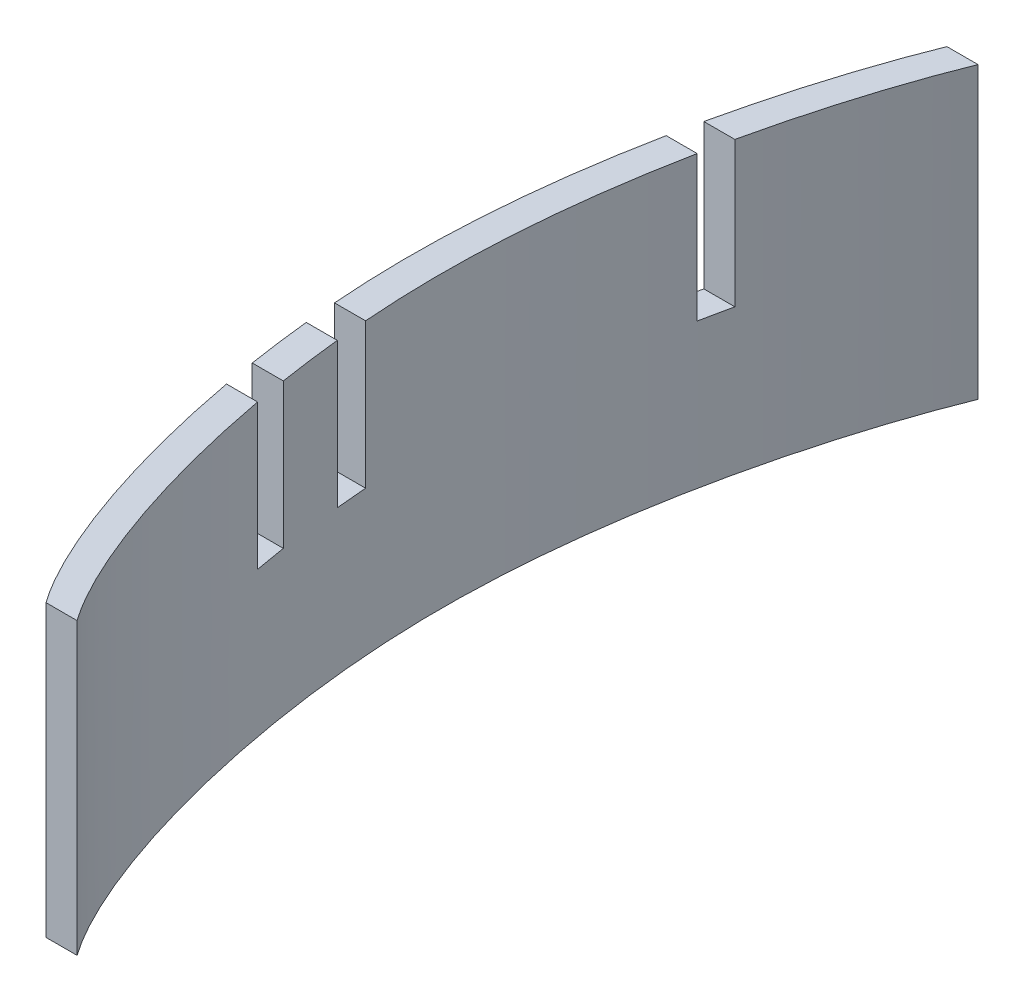
ISO-10303-21;
HEADER;
FILE_DESCRIPTION(('STEP AP214'),'2;1');
FILE_NAME('part.step','',(''),(''),'','','');
FILE_SCHEMA(('AUTOMOTIVE_DESIGN { 1 0 10303 214 1 1 1 1 }'));
ENDSEC;
DATA;
#1=APPLICATION_CONTEXT('core data for automotive mechanical design processes');
#2=APPLICATION_PROTOCOL_DEFINITION('international standard','automotive_design',2000,#1);
#3=PRODUCT_CONTEXT('',#1,'mechanical');
#4=PRODUCT('Part','Part','',(#3));
#5=PRODUCT_RELATED_PRODUCT_CATEGORY('part','',(#4));
#6=PRODUCT_DEFINITION_FORMATION('','',#4);
#7=PRODUCT_DEFINITION_CONTEXT('part definition',#1,'design');
#8=PRODUCT_DEFINITION('design','',#6,#7);
#9=PRODUCT_DEFINITION_SHAPE('','',#8);
#10=(LENGTH_UNIT() NAMED_UNIT(*) SI_UNIT(.MILLI.,.METRE.));
#11=(NAMED_UNIT(*) PLANE_ANGLE_UNIT() SI_UNIT($,.RADIAN.));
#12=(NAMED_UNIT(*) SI_UNIT($,.STERADIAN.) SOLID_ANGLE_UNIT());
#13=UNCERTAINTY_MEASURE_WITH_UNIT(LENGTH_MEASURE(1.E-05),#10,'distance_accuracy_value','');
#14=(GEOMETRIC_REPRESENTATION_CONTEXT(3) GLOBAL_UNCERTAINTY_ASSIGNED_CONTEXT((#13)) GLOBAL_UNIT_ASSIGNED_CONTEXT((#10,
#11,#12)) REPRESENTATION_CONTEXT('',''));
#15=CARTESIAN_POINT('',(0.,0.,0.));
#16=DIRECTION('',(0.,0.,1.));
#17=DIRECTION('',(1.,0.,0.));
#18=AXIS2_PLACEMENT_3D('',#15,#16,#17);
#19=CARTESIAN_POINT('',(-48.7290664504318,0.,571.5));
#20=DIRECTION('',(0.,-1.,0.));
#21=DIRECTION('',(1.,0.,0.));
#22=AXIS2_PLACEMENT_3D('',#19,#20,#21);
#23=PLANE('',#22);
#24=DIRECTION('',(-1.,0.,0.));
#25=VECTOR('',#24,1.);
#26=CARTESIAN_POINT('',(-71.1598715205342,0.,228.6));
#27=LINE('',#26,#25);
#28=CARTESIAN_POINT('',(-31.4992675978472,0.,228.6));
#29=VERTEX_POINT('',#28);
#30=CARTESIAN_POINT('',(-69.5774364766293,0.,228.6));
#31=VERTEX_POINT('',#30);
#32=EDGE_CURVE('E244',#29,#31,#27,.T.);
#33=ORIENTED_EDGE('',*,*,#32,.F.);
#34=CARTESIAN_POINT('',(38.1,0.,0.));
#35=CARTESIAN_POINT('',(-10.0467858208071,0.,118.711942806905));
#36=CARTESIAN_POINT('',(-135.555393431846,0.,564.904353861576));
#37=CARTESIAN_POINT('',(5.93276871520132,0.,1043.95619947961));
#38=CARTESIAN_POINT('',(76.2,0.,1143.));
#39=B_SPLINE_CURVE_WITH_KNOTS('',3,(#34,#35,#36,#37,#38),.UNSPECIFIED.,.F.,.F.,(4,1,4),(0.,
0.498249853333726,1.),.UNSPECIFIED.);
#40=CARTESIAN_POINT('',(38.1,0.,0.));
#41=VERTEX_POINT('',#40);
#42=EDGE_CURVE('E381',#41,#29,#39,.T.);
#43=ORIENTED_EDGE('',*,*,#42,.F.);
#44=DIRECTION('',(1.,0.,0.));
#45=VECTOR('',#44,1.);
#46=CARTESIAN_POINT('',(44.7485655108204,0.,0.));
#47=LINE('',#46,#45);
#48=CARTESIAN_POINT('',(0.,0.,0.));
#49=VERTEX_POINT('',#48);
#50=EDGE_CURVE('E373',#49,#41,#47,.T.);
#51=ORIENTED_EDGE('',*,*,#50,.F.);
#52=CARTESIAN_POINT('',(0.,0.,0.));
#53=CARTESIAN_POINT('',(-48.1467858208071,0.,119.037022806313));
#54=CARTESIAN_POINT('',(-173.658132900864,0.,564.418743215032));
#55=CARTESIAN_POINT('',(-32.1617138562553,0.,1044.60458024195));
#56=CARTESIAN_POINT('',(38.1,0.,1143.));
#57=B_SPLINE_CURVE_WITH_KNOTS('',3,(#52,#53,#54,#55,#56),.UNSPECIFIED.,.F.,.F.,(4,1,4),(0.,
0.498249853333726,1.),.UNSPECIFIED.);
#58=EDGE_CURVE('E383',#49,#31,#57,.T.);
#59=ORIENTED_EDGE('',*,*,#58,.T.);
#60=EDGE_LOOP('',(#33,#43,#51,#59));
#61=FACE_BOUND('',#60,.T.);
#62=ADVANCED_FACE('F26',(#61),#23,.F.);
#63=DIRECTION('',(-1.,0.,0.));
#64=VECTOR('',#63,1.);
#65=CARTESIAN_POINT('',(0.578483325075707,0.,762.));
#66=LINE('',#65,#64);
#67=CARTESIAN_POINT('',(-51.8416475571497,0.,761.999999990289));
#68=VERTEX_POINT('',#67);
#69=CARTESIAN_POINT('',(-89.9624727592618,0.,761.999999990288));
#70=VERTEX_POINT('',#69);
#71=EDGE_CURVE('E231',#68,#70,#66,.T.);
#72=ORIENTED_EDGE('',*,*,#71,.F.);
#73=CARTESIAN_POINT('',(-61.8416678867795,0.,685.8));
#74=VERTEX_POINT('',#73);
#75=EDGE_CURVE('E372',#74,#68,#39,.T.);
#76=ORIENTED_EDGE('',*,*,#75,.F.);
#77=DIRECTION('',(-1.,0.,0.));
#78=VECTOR('',#77,1.);
#79=CARTESIAN_POINT('',(-78.7390953842666,0.,685.8));
#80=LINE('',#79,#78);
#81=CARTESIAN_POINT('',(-99.9482149838871,0.,685.8));
#82=VERTEX_POINT('',#81);
#83=EDGE_CURVE('E281',#74,#82,#80,.T.);
#84=ORIENTED_EDGE('',*,*,#83,.T.);
#85=EDGE_CURVE('E532',#82,#70,#57,.T.);
#86=ORIENTED_EDGE('',*,*,#85,.T.);
#87=EDGE_LOOP('',(#72,#76,#84,#86));
#88=FACE_BOUND('',#87,.T.);
#89=ADVANCED_FACE('F343',(#88),#23,.F.);
#90=CARTESIAN_POINT('',(0.,-355.6,0.));
#91=CARTESIAN_POINT('',(-48.1467858208071,-355.6,119.037022806313));
#92=CARTESIAN_POINT('',(-173.658132900864,-355.6,564.418743215032));
#93=CARTESIAN_POINT('',(-32.1617138562553,-355.6,1044.60458024195));
#94=CARTESIAN_POINT('',(38.1,-355.6,1143.));
#95=B_SPLINE_CURVE_WITH_KNOTS('',3,(#90,#91,#92,#93,#94),.UNSPECIFIED.,.F.,.F.,(4,1,4),(0.,
0.498249853333726,1.),.UNSPECIFIED.);
#96=DIRECTION('',(0.,1.,0.));
#97=VECTOR('',#96,1.);
#98=SURFACE_OF_LINEAR_EXTRUSION('',#95,#97);
#99=CARTESIAN_POINT('',(0.,-177.8,0.));
#100=CARTESIAN_POINT('',(-48.1467858208071,-177.8,119.037022806313));
#101=CARTESIAN_POINT('',(-173.658132900864,-177.8,564.418743215032));
#102=CARTESIAN_POINT('',(-32.1617138562553,-177.8,1044.60458024195));
#103=CARTESIAN_POINT('',(38.1,-177.8,1143.));
#104=B_SPLINE_CURVE_WITH_KNOTS('',3,(#99,#100,#101,#102,#103),.UNSPECIFIED.,.F.,.F.,(4,1,4),(0.,
0.498249853333726,1.),.UNSPECIFIED.);
#105=CARTESIAN_POINT('',(-69.5774364766293,-177.8,228.6));
#106=VERTEX_POINT('',#105);
#107=CARTESIAN_POINT('',(-77.6247615668051,-177.8,266.699999999937));
#108=VERTEX_POINT('',#107);
#109=EDGE_CURVE('E175',#106,#108,#104,.T.);
#110=ORIENTED_EDGE('',*,*,#109,.F.);
#111=DIRECTION('',(0.,1.,0.));
#112=VECTOR('',#111,1.);
#113=CARTESIAN_POINT('',(-69.5774364766293,-177.8,228.6));
#114=LINE('',#113,#112);
#115=EDGE_CURVE('E199',#106,#31,#114,.T.);
#116=ORIENTED_EDGE('',*,*,#115,.T.);
#117=ORIENTED_EDGE('',*,*,#58,.F.);
#118=DIRECTION('',(0.,1.,0.));
#119=VECTOR('',#118,1.);
#120=CARTESIAN_POINT('',(0.,-355.6,0.));
#121=LINE('',#120,#119);
#122=CARTESIAN_POINT('',(0.,-355.6,0.));
#123=VERTEX_POINT('',#122);
#124=EDGE_CURVE('E13',#123,#49,#121,.T.);
#125=ORIENTED_EDGE('',*,*,#124,.F.);
#126=CARTESIAN_POINT('',(38.1,-355.6,1143.));
#127=VERTEX_POINT('',#126);
#128=EDGE_CURVE('E301',#123,#127,#95,.T.);
#129=ORIENTED_EDGE('',*,*,#128,.T.);
#130=DIRECTION('',(0.,1.,0.));
#131=VECTOR('',#130,1.);
#132=CARTESIAN_POINT('',(38.1,-355.6,1143.));
#133=LINE('',#132,#131);
#134=CARTESIAN_POINT('',(38.1,0.,1143.));
#135=VERTEX_POINT('',#134);
#136=EDGE_CURVE('E402',#127,#135,#133,.T.);
#137=ORIENTED_EDGE('',*,*,#136,.T.);
#138=CARTESIAN_POINT('',(-83.432209743934,0.,800.1));
#139=VERTEX_POINT('',#138);
#140=EDGE_CURVE('E300',#139,#135,#57,.T.);
#141=ORIENTED_EDGE('',*,*,#140,.F.);
#142=DIRECTION('',(0.,1.,0.));
#143=VECTOR('',#142,1.);
#144=CARTESIAN_POINT('',(-83.432209743934,-177.8,800.1));
#145=LINE('',#144,#143);
#146=CARTESIAN_POINT('',(-83.432209743934,-177.8,800.1));
#147=VERTEX_POINT('',#146);
#148=EDGE_CURVE('E217',#147,#139,#145,.T.);
#149=ORIENTED_EDGE('',*,*,#148,.F.);
#150=CARTESIAN_POINT('',(0.,-177.8,0.));
#151=CARTESIAN_POINT('',(-48.1467858208071,-177.8,119.037022806313));
#152=CARTESIAN_POINT('',(-173.658132900864,-177.8,564.418743215032));
#153=CARTESIAN_POINT('',(-32.1617138562553,-177.8,1044.60458024195));
#154=CARTESIAN_POINT('',(38.1,-177.8,1143.));
#155=B_SPLINE_CURVE_WITH_KNOTS('',3,(#150,#151,#152,#153,#154),.UNSPECIFIED.,.F.,.F.,(4,1,4),
(0.,0.498249853333726,1.),.UNSPECIFIED.);
#156=CARTESIAN_POINT('',(-89.9624727592618,-177.8,761.999999990288));
#157=VERTEX_POINT('',#156);
#158=EDGE_CURVE('E214',#157,#147,#155,.T.);
#159=ORIENTED_EDGE('',*,*,#158,.F.);
#160=DIRECTION('',(0.,1.,0.));
#161=VECTOR('',#160,1.);
#162=CARTESIAN_POINT('',(-89.9624727592618,-177.8,761.999999990288));
#163=LINE('',#162,#161);
#164=EDGE_CURVE('E248',#157,#70,#163,.T.);
#165=ORIENTED_EDGE('',*,*,#164,.T.);
#166=ORIENTED_EDGE('',*,*,#85,.F.);
#167=DIRECTION('',(0.,1.,0.));
#168=VECTOR('',#167,1.);
#169=CARTESIAN_POINT('',(-99.9482149838871,-177.8,685.8));
#170=LINE('',#169,#168);
#171=CARTESIAN_POINT('',(-99.9482149838871,-177.8,685.8));
#172=VERTEX_POINT('',#171);
#173=EDGE_CURVE('E270',#172,#82,#170,.T.);
#174=ORIENTED_EDGE('',*,*,#173,.F.);
#175=CARTESIAN_POINT('',(0.,-177.8,0.));
#176=CARTESIAN_POINT('',(-48.1467858208071,-177.8,119.037022806313));
#177=CARTESIAN_POINT('',(-173.658132900864,-177.8,564.418743215032));
#178=CARTESIAN_POINT('',(-32.1617138562553,-177.8,1044.60458024195));
#179=CARTESIAN_POINT('',(38.1,-177.8,1143.));
#180=B_SPLINE_CURVE_WITH_KNOTS('',3,(#175,#176,#177,#178,#179),.UNSPECIFIED.,.F.,.F.,(4,1,4),
(0.,0.498249853333726,1.),.UNSPECIFIED.);
#181=CARTESIAN_POINT('',(-103.378321645484,-177.8,647.700000003491));
#182=VERTEX_POINT('',#181);
#183=EDGE_CURVE('E262',#182,#172,#180,.T.);
#184=ORIENTED_EDGE('',*,*,#183,.F.);
#185=DIRECTION('',(0.,1.,0.));
#186=VECTOR('',#185,1.);
#187=CARTESIAN_POINT('',(-103.378321645484,-177.8,647.700000003491));
#188=LINE('',#187,#186);
#189=CARTESIAN_POINT('',(-103.378321645484,0.,647.700000003491));
#190=VERTEX_POINT('',#189);
#191=EDGE_CURVE('E290',#182,#190,#188,.T.);
#192=ORIENTED_EDGE('',*,*,#191,.T.);
#193=CARTESIAN_POINT('',(-77.6247615668051,0.,266.699999999937));
#194=VERTEX_POINT('',#193);
#195=EDGE_CURVE('E197',#194,#190,#57,.T.);
#196=ORIENTED_EDGE('',*,*,#195,.F.);
#197=DIRECTION('',(0.,1.,0.));
#198=VECTOR('',#197,1.);
#199=CARTESIAN_POINT('',(-77.6247615668051,-177.8,266.699999999937));
#200=LINE('',#199,#198);
#201=EDGE_CURVE('E187',#108,#194,#200,.T.);
#202=ORIENTED_EDGE('',*,*,#201,.F.);
#203=EDGE_LOOP('',(#110,#116,#117,#125,#129,#137,#141,#149,#159,#165,#166,#174,#184,#192,#196,#202));
#204=FACE_BOUND('',#203,.T.);
#205=ADVANCED_FACE('F28',(#204),#98,.T.);
#206=CARTESIAN_POINT('',(-39.5402036904433,0.,266.699999999938));
#207=VERTEX_POINT('',#206);
#208=CARTESIAN_POINT('',(-65.2757125774557,0.,647.700000003653));
#209=VERTEX_POINT('',#208);
#210=EDGE_CURVE('E375',#207,#209,#39,.T.);
#211=ORIENTED_EDGE('',*,*,#210,.F.);
#212=DIRECTION('',(-1.,0.,0.));
#213=VECTOR('',#212,1.);
#214=CARTESIAN_POINT('',(-77.1633275361347,0.,266.7));
#215=LINE('',#214,#213);
#216=EDGE_CURVE('E183',#207,#194,#215,.T.);
#217=ORIENTED_EDGE('',*,*,#216,.T.);
#218=ORIENTED_EDGE('',*,*,#195,.T.);
#219=DIRECTION('',(-1.,0.,0.));
#220=VECTOR('',#219,1.);
#221=CARTESIAN_POINT('',(-81.5796891418827,0.,647.7));
#222=LINE('',#221,#220);
#223=EDGE_CURVE('E277',#209,#190,#222,.T.);
#224=ORIENTED_EDGE('',*,*,#223,.F.);
#225=EDGE_LOOP('',(#211,#217,#218,#224));
#226=FACE_BOUND('',#225,.T.);
#227=ADVANCED_FACE('F335',(#226),#23,.F.);
#228=CARTESIAN_POINT('',(44.7485655108204,-355.6,0.));
#229=DIRECTION('',(0.,0.,1.));
#230=DIRECTION('',(1.,0.,0.));
#231=AXIS2_PLACEMENT_3D('',#228,#229,#230);
#232=PLANE('',#231);
#233=ORIENTED_EDGE('',*,*,#50,.T.);
#234=DIRECTION('',(0.,1.,0.));
#235=VECTOR('',#234,1.);
#236=CARTESIAN_POINT('',(38.1,-355.6,0.));
#237=LINE('',#236,#235);
#238=CARTESIAN_POINT('',(38.1,-355.6,0.));
#239=VERTEX_POINT('',#238);
#240=EDGE_CURVE('E36',#239,#41,#237,.T.);
#241=ORIENTED_EDGE('',*,*,#240,.F.);
#242=DIRECTION('',(1.,0.,0.));
#243=VECTOR('',#242,1.);
#244=CARTESIAN_POINT('',(44.7485655108204,-355.6,0.));
#245=LINE('',#244,#243);
#246=EDGE_CURVE('E308',#123,#239,#245,.T.);
#247=ORIENTED_EDGE('',*,*,#246,.F.);
#248=ORIENTED_EDGE('',*,*,#124,.T.);
#249=EDGE_LOOP('',(#233,#241,#247,#248));
#250=FACE_BOUND('',#249,.T.);
#251=ADVANCED_FACE('F331',(#250),#232,.F.);
#252=CARTESIAN_POINT('',(38.1,-355.6,0.));
#253=CARTESIAN_POINT('',(-10.0467858208071,-355.6,118.711942806905));
#254=CARTESIAN_POINT('',(-135.555393431846,-355.6,564.904353861576));
#255=CARTESIAN_POINT('',(5.93276871520132,-355.6,1043.95619947961));
#256=CARTESIAN_POINT('',(76.2,-355.6,1143.));
#257=B_SPLINE_CURVE_WITH_KNOTS('',3,(#252,#253,#254,#255,#256),.UNSPECIFIED.,.F.,.F.,(4,1,4),
(0.,0.498249853333726,1.),.UNSPECIFIED.);
#258=DIRECTION('',(0.,1.,0.));
#259=VECTOR('',#258,1.);
#260=SURFACE_OF_LINEAR_EXTRUSION('',#257,#259);
#261=CARTESIAN_POINT('',(38.1,-177.8,0.));
#262=CARTESIAN_POINT('',(-10.0467858208071,-177.8,118.711942806905));
#263=CARTESIAN_POINT('',(-135.555393431846,-177.8,564.904353861576));
#264=CARTESIAN_POINT('',(5.93276871520132,-177.8,1043.95619947961));
#265=CARTESIAN_POINT('',(76.2,-177.8,1143.));
#266=B_SPLINE_CURVE_WITH_KNOTS('',3,(#261,#262,#263,#264,#265),.UNSPECIFIED.,.F.,.F.,(4,1,4),
(0.,0.498249853333726,1.),.UNSPECIFIED.);
#267=CARTESIAN_POINT('',(-31.4992675978472,-177.8,228.6));
#268=VERTEX_POINT('',#267);
#269=CARTESIAN_POINT('',(-39.5402036904557,-177.8,266.7));
#270=VERTEX_POINT('',#269);
#271=EDGE_CURVE('E193',#268,#270,#266,.T.);
#272=ORIENTED_EDGE('',*,*,#271,.T.);
#273=DIRECTION('',(0.,1.,0.));
#274=VECTOR('',#273,1.);
#275=CARTESIAN_POINT('',(-39.5402036904433,-177.8,266.699999999938));
#276=LINE('',#275,#274);
#277=EDGE_CURVE('E190',#270,#207,#276,.T.);
#278=ORIENTED_EDGE('',*,*,#277,.T.);
#279=ORIENTED_EDGE('',*,*,#210,.T.);
#280=DIRECTION('',(0.,1.,0.));
#281=VECTOR('',#280,1.);
#282=CARTESIAN_POINT('',(-65.2757125774557,-177.8,647.700000003653));
#283=LINE('',#282,#281);
#284=CARTESIAN_POINT('',(-65.2757125774557,-177.8,647.700000003653));
#285=VERTEX_POINT('',#284);
#286=EDGE_CURVE('E293',#285,#209,#283,.T.);
#287=ORIENTED_EDGE('',*,*,#286,.F.);
#288=CARTESIAN_POINT('',(38.1,-177.8,0.));
#289=CARTESIAN_POINT('',(-10.0467858208071,-177.8,118.711942806905));
#290=CARTESIAN_POINT('',(-135.555393431846,-177.8,564.904353861576));
#291=CARTESIAN_POINT('',(5.93276871520132,-177.8,1043.95619947961));
#292=CARTESIAN_POINT('',(76.2,-177.8,1143.));
#293=B_SPLINE_CURVE_WITH_KNOTS('',3,(#288,#289,#290,#291,#292),.UNSPECIFIED.,.F.,.F.,(4,1,4),
(0.,0.498249853333726,1.),.UNSPECIFIED.);
#294=CARTESIAN_POINT('',(-61.8416678867795,-177.8,685.8));
#295=VERTEX_POINT('',#294);
#296=EDGE_CURVE('E254',#285,#295,#293,.T.);
#297=ORIENTED_EDGE('',*,*,#296,.T.);
#298=DIRECTION('',(0.,1.,0.));
#299=VECTOR('',#298,1.);
#300=CARTESIAN_POINT('',(-61.8416678867795,-177.8,685.8));
#301=LINE('',#300,#299);
#302=EDGE_CURVE('E297',#295,#74,#301,.T.);
#303=ORIENTED_EDGE('',*,*,#302,.T.);
#304=ORIENTED_EDGE('',*,*,#75,.T.);
#305=DIRECTION('',(0.,1.,0.));
#306=VECTOR('',#305,1.);
#307=CARTESIAN_POINT('',(-51.8416475571497,-177.8,761.999999990289));
#308=LINE('',#307,#306);
#309=CARTESIAN_POINT('',(-51.8416475571497,-177.8,761.999999990289));
#310=VERTEX_POINT('',#309);
#311=EDGE_CURVE('E245',#310,#68,#308,.T.);
#312=ORIENTED_EDGE('',*,*,#311,.F.);
#313=CARTESIAN_POINT('',(38.1,-177.8,0.));
#314=CARTESIAN_POINT('',(-10.0467858208071,-177.8,118.711942806905));
#315=CARTESIAN_POINT('',(-135.555393431846,-177.8,564.904353861576));
#316=CARTESIAN_POINT('',(5.93276871520132,-177.8,1043.95619947961));
#317=CARTESIAN_POINT('',(76.2,-177.8,1143.));
#318=B_SPLINE_CURVE_WITH_KNOTS('',3,(#313,#314,#315,#316,#317),.UNSPECIFIED.,.F.,.F.,(4,1,4),
(0.,0.498249853333726,1.),.UNSPECIFIED.);
#319=CARTESIAN_POINT('',(-45.3009926513268,-177.8,800.1));
#320=VERTEX_POINT('',#319);
#321=EDGE_CURVE('E213',#310,#320,#318,.T.);
#322=ORIENTED_EDGE('',*,*,#321,.T.);
#323=DIRECTION('',(0.,1.,0.));
#324=VECTOR('',#323,1.);
#325=CARTESIAN_POINT('',(-45.3009926513255,-177.8,800.1));
#326=LINE('',#325,#324);
#327=CARTESIAN_POINT('',(-45.3009926513255,0.,800.1));
#328=VERTEX_POINT('',#327);
#329=EDGE_CURVE('E240',#320,#328,#326,.T.);
#330=ORIENTED_EDGE('',*,*,#329,.T.);
#331=CARTESIAN_POINT('',(76.2,0.,1143.));
#332=VERTEX_POINT('',#331);
#333=EDGE_CURVE('E366',#328,#332,#39,.T.);
#334=ORIENTED_EDGE('',*,*,#333,.T.);
#335=DIRECTION('',(0.,1.,0.));
#336=VECTOR('',#335,1.);
#337=CARTESIAN_POINT('',(76.2,-355.6,1143.));
#338=LINE('',#337,#336);
#339=CARTESIAN_POINT('',(76.2,-355.6,1143.));
#340=VERTEX_POINT('',#339);
#341=EDGE_CURVE('E406',#340,#332,#338,.T.);
#342=ORIENTED_EDGE('',*,*,#341,.F.);
#343=EDGE_CURVE('E315',#239,#340,#257,.T.);
#344=ORIENTED_EDGE('',*,*,#343,.F.);
#345=ORIENTED_EDGE('',*,*,#240,.T.);
#346=ORIENTED_EDGE('',*,*,#42,.T.);
#347=DIRECTION('',(0.,1.,0.));
#348=VECTOR('',#347,1.);
#349=CARTESIAN_POINT('',(-31.4992675978472,-177.8,228.6));
#350=LINE('',#349,#348);
#351=EDGE_CURVE('E205',#268,#29,#350,.T.);
#352=ORIENTED_EDGE('',*,*,#351,.F.);
#353=EDGE_LOOP('',(#272,#278,#279,#287,#297,#303,#304,#312,#322,#330,#334,#342,#344,#345,#346,#352));
#354=FACE_BOUND('',#353,.T.);
#355=ADVANCED_FACE('F327',(#354),#260,.F.);
#356=CARTESIAN_POINT('',(48.1458373560539,-355.6,1143.));
#357=DIRECTION('',(0.,0.,1.));
#358=DIRECTION('',(1.,0.,0.));
#359=AXIS2_PLACEMENT_3D('',#356,#357,#358);
#360=PLANE('',#359);
#361=DIRECTION('',(1.,0.,0.));
#362=VECTOR('',#361,1.);
#363=CARTESIAN_POINT('',(48.1458373560539,0.,1143.));
#364=LINE('',#363,#362);
#365=EDGE_CURVE('E309',#135,#332,#364,.T.);
#366=ORIENTED_EDGE('',*,*,#365,.F.);
#367=ORIENTED_EDGE('',*,*,#136,.F.);
#368=DIRECTION('',(1.,0.,0.));
#369=VECTOR('',#368,1.);
#370=CARTESIAN_POINT('',(48.1458373560539,-355.6,1143.));
#371=LINE('',#370,#369);
#372=EDGE_CURVE('E321',#127,#340,#371,.T.);
#373=ORIENTED_EDGE('',*,*,#372,.T.);
#374=ORIENTED_EDGE('',*,*,#341,.T.);
#375=EDGE_LOOP('',(#366,#367,#373,#374));
#376=FACE_BOUND('',#375,.T.);
#377=ADVANCED_FACE('F330',(#376),#360,.T.);
#378=CARTESIAN_POINT('',(-48.7290664504318,-355.6,571.5));
#379=DIRECTION('',(0.,-1.,0.));
#380=DIRECTION('',(1.,0.,0.));
#381=AXIS2_PLACEMENT_3D('',#378,#379,#380);
#382=PLANE('',#381);
#383=ORIENTED_EDGE('',*,*,#128,.F.);
#384=ORIENTED_EDGE('',*,*,#246,.T.);
#385=ORIENTED_EDGE('',*,*,#343,.T.);
#386=ORIENTED_EDGE('',*,*,#372,.F.);
#387=EDGE_LOOP('',(#383,#384,#385,#386));
#388=FACE_BOUND('',#387,.T.);
#389=ADVANCED_FACE('F354',(#388),#382,.T.);
#390=ORIENTED_EDGE('',*,*,#333,.F.);
#391=DIRECTION('',(-1.,0.,0.));
#392=VECTOR('',#391,1.);
#393=CARTESIAN_POINT('',(9.22358363799858,0.,800.1));
#394=LINE('',#393,#392);
#395=EDGE_CURVE('E230',#328,#139,#394,.T.);
#396=ORIENTED_EDGE('',*,*,#395,.T.);
#397=ORIENTED_EDGE('',*,*,#140,.T.);
#398=ORIENTED_EDGE('',*,*,#365,.T.);
#399=EDGE_LOOP('',(#390,#396,#397,#398));
#400=FACE_BOUND('',#399,.T.);
#401=ADVANCED_FACE('F342',(#400),#23,.F.);
#402=CARTESIAN_POINT('',(-78.7390953842666,-177.8,685.8));
#403=DIRECTION('',(0.,0.,-1.));
#404=DIRECTION('',(-1.,0.,0.));
#405=AXIS2_PLACEMENT_3D('',#402,#403,#404);
#406=PLANE('',#405);
#407=ORIENTED_EDGE('',*,*,#83,.F.);
#408=ORIENTED_EDGE('',*,*,#302,.F.);
#409=DIRECTION('',(-1.,0.,0.));
#410=VECTOR('',#409,1.);
#411=CARTESIAN_POINT('',(-78.7390953842666,-177.8,685.8));
#412=LINE('',#411,#410);
#413=EDGE_CURVE('E261',#295,#172,#412,.T.);
#414=ORIENTED_EDGE('',*,*,#413,.T.);
#415=ORIENTED_EDGE('',*,*,#173,.T.);
#416=EDGE_LOOP('',(#407,#408,#414,#415));
#417=FACE_BOUND('',#416,.T.);
#418=ADVANCED_FACE('F353',(#417),#406,.T.);
#419=CARTESIAN_POINT('',(-81.5796891418827,-177.8,647.7));
#420=DIRECTION('',(0.,0.,-1.));
#421=DIRECTION('',(-1.,0.,0.));
#422=AXIS2_PLACEMENT_3D('',#419,#420,#421);
#423=PLANE('',#422);
#424=ORIENTED_EDGE('',*,*,#223,.T.);
#425=ORIENTED_EDGE('',*,*,#191,.F.);
#426=DIRECTION('',(-1.,0.,0.));
#427=VECTOR('',#426,1.);
#428=CARTESIAN_POINT('',(-81.5796891418827,-177.8,647.7));
#429=LINE('',#428,#427);
#430=EDGE_CURVE('E260',#285,#182,#429,.T.);
#431=ORIENTED_EDGE('',*,*,#430,.F.);
#432=ORIENTED_EDGE('',*,*,#286,.T.);
#433=EDGE_LOOP('',(#424,#425,#431,#432));
#434=FACE_BOUND('',#433,.T.);
#435=ADVANCED_FACE('F360',(#434),#423,.F.);
#436=CARTESIAN_POINT('',(-48.7290664504318,-177.8,571.5));
#437=DIRECTION('',(0.,1.,0.));
#438=DIRECTION('',(-1.,0.,0.));
#439=AXIS2_PLACEMENT_3D('',#436,#437,#438);
#440=PLANE('',#439);
#441=ORIENTED_EDGE('',*,*,#413,.F.);
#442=ORIENTED_EDGE('',*,*,#296,.F.);
#443=ORIENTED_EDGE('',*,*,#430,.T.);
#444=ORIENTED_EDGE('',*,*,#183,.T.);
#445=EDGE_LOOP('',(#441,#442,#443,#444));
#446=FACE_BOUND('',#445,.T.);
#447=ADVANCED_FACE('F452',(#446),#440,.T.);
#448=CARTESIAN_POINT('',(9.22358363799858,-177.8,800.1));
#449=DIRECTION('',(0.,0.,-1.));
#450=DIRECTION('',(-1.,0.,0.));
#451=AXIS2_PLACEMENT_3D('',#448,#449,#450);
#452=PLANE('',#451);
#453=ORIENTED_EDGE('',*,*,#395,.F.);
#454=ORIENTED_EDGE('',*,*,#329,.F.);
#455=DIRECTION('',(-1.,0.,0.));
#456=VECTOR('',#455,1.);
#457=CARTESIAN_POINT('',(9.22358363799858,-177.8,800.1));
#458=LINE('',#457,#456);
#459=EDGE_CURVE('E60',#320,#147,#458,.T.);
#460=ORIENTED_EDGE('',*,*,#459,.T.);
#461=ORIENTED_EDGE('',*,*,#148,.T.);
#462=EDGE_LOOP('',(#453,#454,#460,#461));
#463=FACE_BOUND('',#462,.T.);
#464=ADVANCED_FACE('F446',(#463),#452,.T.);
#465=CARTESIAN_POINT('',(0.578483325075707,-177.8,762.));
#466=DIRECTION('',(0.,0.,-1.));
#467=DIRECTION('',(-1.,0.,0.));
#468=AXIS2_PLACEMENT_3D('',#465,#466,#467);
#469=PLANE('',#468);
#470=ORIENTED_EDGE('',*,*,#71,.T.);
#471=ORIENTED_EDGE('',*,*,#164,.F.);
#472=DIRECTION('',(-1.,0.,0.));
#473=VECTOR('',#472,1.);
#474=CARTESIAN_POINT('',(0.578483325075707,-177.8,762.));
#475=LINE('',#474,#473);
#476=EDGE_CURVE('E209',#310,#157,#475,.T.);
#477=ORIENTED_EDGE('',*,*,#476,.F.);
#478=ORIENTED_EDGE('',*,*,#311,.T.);
#479=EDGE_LOOP('',(#470,#471,#477,#478));
#480=FACE_BOUND('',#479,.T.);
#481=ADVANCED_FACE('F451',(#480),#469,.F.);
#482=CARTESIAN_POINT('',(-48.7290664504318,-177.8,571.5));
#483=DIRECTION('',(0.,1.,0.));
#484=DIRECTION('',(-1.,0.,0.));
#485=AXIS2_PLACEMENT_3D('',#482,#483,#484);
#486=PLANE('',#485);
#487=ORIENTED_EDGE('',*,*,#459,.F.);
#488=ORIENTED_EDGE('',*,*,#321,.F.);
#489=ORIENTED_EDGE('',*,*,#476,.T.);
#490=ORIENTED_EDGE('',*,*,#158,.T.);
#491=EDGE_LOOP('',(#487,#488,#489,#490));
#492=FACE_BOUND('',#491,.T.);
#493=ADVANCED_FACE('F460',(#492),#486,.T.);
#494=CARTESIAN_POINT('',(-77.1633275361347,-177.8,266.7));
#495=DIRECTION('',(0.,0.,-1.));
#496=DIRECTION('',(-1.,0.,0.));
#497=AXIS2_PLACEMENT_3D('',#494,#495,#496);
#498=PLANE('',#497);
#499=ORIENTED_EDGE('',*,*,#216,.F.);
#500=ORIENTED_EDGE('',*,*,#277,.F.);
#501=DIRECTION('',(-1.,0.,0.));
#502=VECTOR('',#501,1.);
#503=CARTESIAN_POINT('',(-77.1633275361347,-177.8,266.7));
#504=LINE('',#503,#502);
#505=EDGE_CURVE('E48',#270,#108,#504,.T.);
#506=ORIENTED_EDGE('',*,*,#505,.T.);
#507=ORIENTED_EDGE('',*,*,#201,.T.);
#508=EDGE_LOOP('',(#499,#500,#506,#507));
#509=FACE_BOUND('',#508,.T.);
#510=ADVANCED_FACE('F186',(#509),#498,.T.);
#511=CARTESIAN_POINT('',(-71.1598715205342,-177.8,228.6));
#512=DIRECTION('',(0.,0.,-1.));
#513=DIRECTION('',(-1.,0.,0.));
#514=AXIS2_PLACEMENT_3D('',#511,#512,#513);
#515=PLANE('',#514);
#516=ORIENTED_EDGE('',*,*,#32,.T.);
#517=ORIENTED_EDGE('',*,*,#115,.F.);
#518=DIRECTION('',(-1.,0.,0.));
#519=VECTOR('',#518,1.);
#520=CARTESIAN_POINT('',(-71.1598715205342,-177.8,228.6));
#521=LINE('',#520,#519);
#522=EDGE_CURVE('E178',#268,#106,#521,.T.);
#523=ORIENTED_EDGE('',*,*,#522,.F.);
#524=ORIENTED_EDGE('',*,*,#351,.T.);
#525=EDGE_LOOP('',(#516,#517,#523,#524));
#526=FACE_BOUND('',#525,.T.);
#527=ADVANCED_FACE('F428',(#526),#515,.F.);
#528=CARTESIAN_POINT('',(-48.7290664504318,-177.8,571.5));
#529=DIRECTION('',(0.,1.,0.));
#530=DIRECTION('',(-1.,0.,0.));
#531=AXIS2_PLACEMENT_3D('',#528,#529,#530);
#532=PLANE('',#531);
#533=ORIENTED_EDGE('',*,*,#505,.F.);
#534=ORIENTED_EDGE('',*,*,#271,.F.);
#535=ORIENTED_EDGE('',*,*,#522,.T.);
#536=ORIENTED_EDGE('',*,*,#109,.T.);
#537=EDGE_LOOP('',(#533,#534,#535,#536));
#538=FACE_BOUND('',#537,.T.);
#539=ADVANCED_FACE('F176',(#538),#532,.T.);
#540=CLOSED_SHELL('',(#62,#89,#205,#227,#251,#355,#377,#389,#401,#418,#435,#447,#464,#481,#493,
#510,#527,#539));
#541=MANIFOLD_SOLID_BREP('B1',#540);
#542=ADVANCED_BREP_SHAPE_REPRESENTATION('',(#18,#541),#14);
#543=SHAPE_DEFINITION_REPRESENTATION(#9,#542);
ENDSEC;
END-ISO-10303-21;
